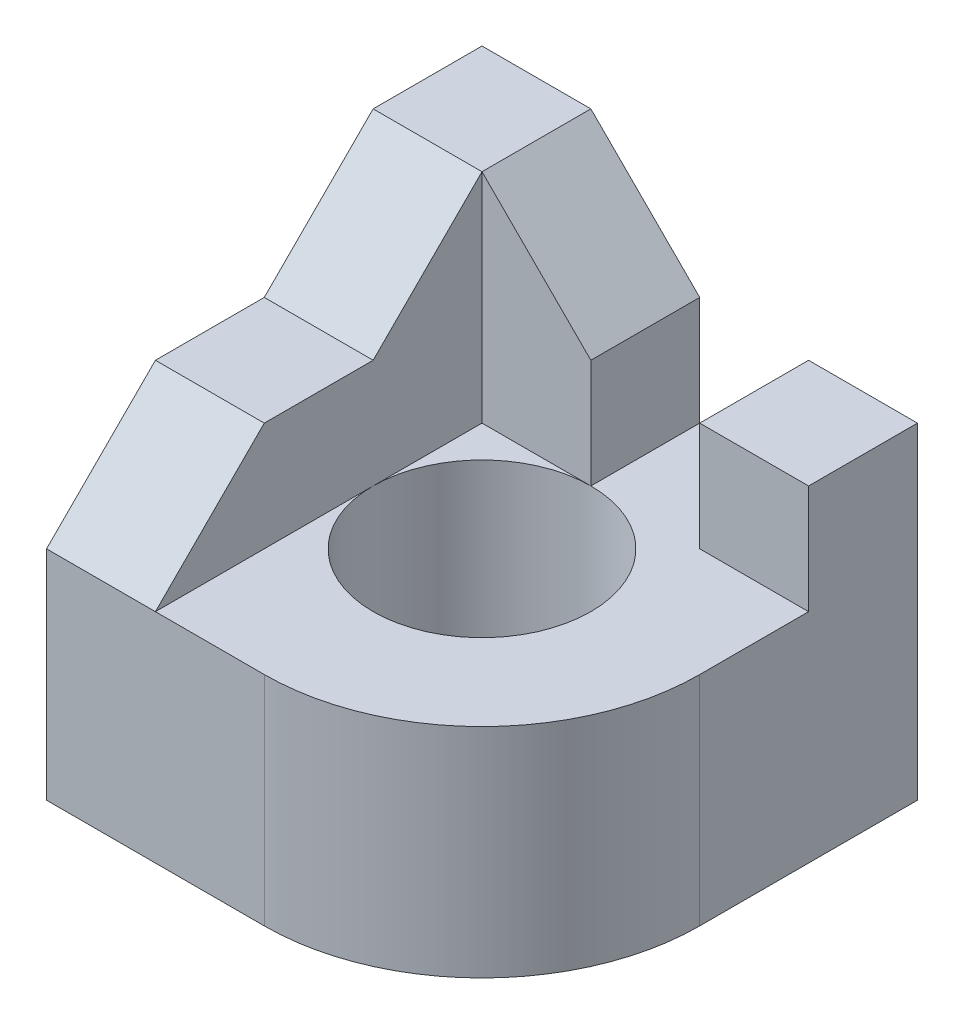
ISO-10303-21;
HEADER;
FILE_DESCRIPTION(('STEP AP214'),'2;1');
FILE_NAME('part.step','',(''),(''),'','','');
FILE_SCHEMA(('AUTOMOTIVE_DESIGN { 1 0 10303 214 1 1 1 1 }'));
ENDSEC;
DATA;
#1=APPLICATION_CONTEXT('core data for automotive mechanical design processes');
#2=APPLICATION_PROTOCOL_DEFINITION('international standard','automotive_design',2000,#1);
#3=PRODUCT_CONTEXT('',#1,'mechanical');
#4=PRODUCT('Part','Part','',(#3));
#5=PRODUCT_RELATED_PRODUCT_CATEGORY('part','',(#4));
#6=PRODUCT_DEFINITION_FORMATION('','',#4);
#7=PRODUCT_DEFINITION_CONTEXT('part definition',#1,'design');
#8=PRODUCT_DEFINITION('design','',#6,#7);
#9=PRODUCT_DEFINITION_SHAPE('','',#8);
#10=(LENGTH_UNIT() NAMED_UNIT(*) SI_UNIT(.MILLI.,.METRE.));
#11=(NAMED_UNIT(*) PLANE_ANGLE_UNIT() SI_UNIT($,.RADIAN.));
#12=(NAMED_UNIT(*) SI_UNIT($,.STERADIAN.) SOLID_ANGLE_UNIT());
#13=UNCERTAINTY_MEASURE_WITH_UNIT(LENGTH_MEASURE(1.E-05),#10,'distance_accuracy_value','');
#14=(GEOMETRIC_REPRESENTATION_CONTEXT(3) GLOBAL_UNCERTAINTY_ASSIGNED_CONTEXT((#13)) GLOBAL_UNIT_ASSIGNED_CONTEXT((#10,
#11,#12)) REPRESENTATION_CONTEXT('',''));
#15=CARTESIAN_POINT('',(0.,0.,0.));
#16=DIRECTION('',(0.,0.,1.));
#17=DIRECTION('',(1.,0.,0.));
#18=AXIS2_PLACEMENT_3D('',#15,#16,#17);
#19=CARTESIAN_POINT('',(0.,2.,0.));
#20=DIRECTION('',(0.,-1.,0.));
#21=DIRECTION('',(0.,0.,-1.));
#22=AXIS2_PLACEMENT_3D('',#19,#20,#21);
#23=CYLINDRICAL_SURFACE('',#22,1.);
#24=CARTESIAN_POINT('',(0.,0.,0.));
#25=DIRECTION('',(0.,1.,0.));
#26=DIRECTION('',(0.,0.,1.));
#27=AXIS2_PLACEMENT_3D('',#24,#25,#26);
#28=CIRCLE('',#27,1.);
#29=CARTESIAN_POINT('',(0.,0.,1.));
#30=VERTEX_POINT('',#29);
#31=EDGE_CURVE('E280',#30,#30,#28,.T.);
#32=ORIENTED_EDGE('',*,*,#31,.F.);
#33=EDGE_LOOP('',(#32));
#34=FACE_BOUND('',#33,.T.);
#35=CARTESIAN_POINT('',(0.,2.,0.));
#36=DIRECTION('',(0.,1.,0.));
#37=DIRECTION('',(0.,0.,1.));
#38=AXIS2_PLACEMENT_3D('',#35,#36,#37);
#39=CIRCLE('',#38,1.);
#40=CARTESIAN_POINT('',(-1.,2.,0.));
#41=VERTEX_POINT('',#40);
#42=CARTESIAN_POINT('',(0.,2.,-0.999999999999996));
#43=VERTEX_POINT('',#42);
#44=EDGE_CURVE('E225',#41,#43,#39,.T.);
#45=ORIENTED_EDGE('',*,*,#44,.T.);
#46=CARTESIAN_POINT('',(0.,2.,0.));
#47=DIRECTION('',(0.,1.,0.));
#48=DIRECTION('',(0.,0.,1.));
#49=AXIS2_PLACEMENT_3D('',#46,#47,#48);
#50=CIRCLE('',#49,1.);
#51=EDGE_CURVE('E281',#43,#41,#50,.T.);
#52=ORIENTED_EDGE('',*,*,#51,.T.);
#53=EDGE_LOOP('',(#45,#52));
#54=FACE_BOUND('',#53,.T.);
#55=ADVANCED_FACE('F71',(#34,#54),#23,.F.);
#56=CARTESIAN_POINT('',(0.,2.,0.));
#57=DIRECTION('',(0.,1.,0.));
#58=DIRECTION('',(0.,0.,1.));
#59=AXIS2_PLACEMENT_3D('',#56,#57,#58);
#60=PLANE('',#59);
#61=ORIENTED_EDGE('',*,*,#51,.F.);
#62=DIRECTION('',(1.,0.,0.));
#63=VECTOR('',#62,1.);
#64=CARTESIAN_POINT('',(0.,2.,-0.999999999999996));
#65=LINE('',#64,#63);
#66=CARTESIAN_POINT('',(-1.,2.,-0.999999999999996));
#67=VERTEX_POINT('',#66);
#68=EDGE_CURVE('E284',#67,#43,#65,.T.);
#69=ORIENTED_EDGE('',*,*,#68,.F.);
#70=DIRECTION('',(0.,0.,1.));
#71=VECTOR('',#70,1.);
#72=CARTESIAN_POINT('',(-1.,2.,0.));
#73=LINE('',#72,#71);
#74=EDGE_CURVE('E287',#67,#41,#73,.T.);
#75=ORIENTED_EDGE('',*,*,#74,.T.);
#76=EDGE_LOOP('',(#61,#69,#75));
#77=FACE_BOUND('',#76,.T.);
#78=ADVANCED_FACE('F357',(#77),#60,.T.);
#79=CARTESIAN_POINT('',(0.,0.,0.));
#80=DIRECTION('',(0.,1.,0.));
#81=DIRECTION('',(0.,0.,1.));
#82=AXIS2_PLACEMENT_3D('',#79,#80,#81);
#83=PLANE('',#82);
#84=DIRECTION('',(-1.,0.,0.));
#85=VECTOR('',#84,1.);
#86=CARTESIAN_POINT('',(0.,0.,-2.));
#87=LINE('',#86,#85);
#88=CARTESIAN_POINT('',(2.,0.,-2.));
#89=VERTEX_POINT('',#88);
#90=CARTESIAN_POINT('',(-2.,0.,-2.));
#91=VERTEX_POINT('',#90);
#92=EDGE_CURVE('E262',#89,#91,#87,.T.);
#93=ORIENTED_EDGE('',*,*,#92,.F.);
#94=DIRECTION('',(0.,0.,1.));
#95=VECTOR('',#94,1.);
#96=CARTESIAN_POINT('',(2.,0.,0.));
#97=LINE('',#96,#95);
#98=CARTESIAN_POINT('',(2.,0.,0.));
#99=VERTEX_POINT('',#98);
#100=EDGE_CURVE('E229',#89,#99,#97,.T.);
#101=ORIENTED_EDGE('',*,*,#100,.T.);
#102=CARTESIAN_POINT('',(0.,0.,0.));
#103=DIRECTION('',(0.,1.,0.));
#104=DIRECTION('',(0.,0.,1.));
#105=AXIS2_PLACEMENT_3D('',#102,#103,#104);
#106=CIRCLE('',#105,2.);
#107=CARTESIAN_POINT('',(0.,0.,2.));
#108=VERTEX_POINT('',#107);
#109=EDGE_CURVE('E254',#99,#108,#106,.F.);
#110=ORIENTED_EDGE('',*,*,#109,.T.);
#111=DIRECTION('',(-1.,0.,0.));
#112=VECTOR('',#111,1.);
#113=CARTESIAN_POINT('',(0.,0.,2.));
#114=LINE('',#113,#112);
#115=CARTESIAN_POINT('',(-2.,0.,2.));
#116=VERTEX_POINT('',#115);
#117=EDGE_CURVE('E224',#108,#116,#114,.T.);
#118=ORIENTED_EDGE('',*,*,#117,.T.);
#119=DIRECTION('',(0.,0.,1.));
#120=VECTOR('',#119,1.);
#121=CARTESIAN_POINT('',(-2.,0.,0.));
#122=LINE('',#121,#120);
#123=EDGE_CURVE('E266',#91,#116,#122,.T.);
#124=ORIENTED_EDGE('',*,*,#123,.F.);
#125=EDGE_LOOP('',(#93,#101,#110,#118,#124));
#126=FACE_BOUND('',#125,.T.);
#127=ORIENTED_EDGE('',*,*,#31,.T.);
#128=EDGE_LOOP('',(#127));
#129=FACE_BOUND('',#128,.T.);
#130=ADVANCED_FACE('F318',(#126,#129),#83,.F.);
#131=CARTESIAN_POINT('',(0.,4.,-0.999999999999996));
#132=DIRECTION('',(0.,0.,-1.));
#133=DIRECTION('',(-1.,0.,0.));
#134=AXIS2_PLACEMENT_3D('',#131,#132,#133);
#135=PLANE('',#134);
#136=DIRECTION('',(0.,-1.,0.));
#137=VECTOR('',#136,1.);
#138=CARTESIAN_POINT('',(0.,4.,-0.999999999999996));
#139=LINE('',#138,#137);
#140=CARTESIAN_POINT('',(0.,3.,-0.999999999999996));
#141=VERTEX_POINT('',#140);
#142=EDGE_CURVE('E278',#141,#43,#139,.T.);
#143=ORIENTED_EDGE('',*,*,#142,.F.);
#144=DIRECTION('',(-0.707106781186546,0.707106781186549,0.));
#145=VECTOR('',#144,1.);
#146=CARTESIAN_POINT('',(-1.,4.,-0.999999999999996));
#147=LINE('',#146,#145);
#148=CARTESIAN_POINT('',(-1.,4.,-0.999999999999996));
#149=VERTEX_POINT('',#148);
#150=EDGE_CURVE('E302',#141,#149,#147,.T.);
#151=ORIENTED_EDGE('',*,*,#150,.T.);
#152=DIRECTION('',(0.,-1.,0.));
#153=VECTOR('',#152,1.);
#154=CARTESIAN_POINT('',(-1.,4.,-0.999999999999996));
#155=LINE('',#154,#153);
#156=EDGE_CURVE('E184',#149,#67,#155,.T.);
#157=ORIENTED_EDGE('',*,*,#156,.T.);
#158=ORIENTED_EDGE('',*,*,#68,.T.);
#159=EDGE_LOOP('',(#143,#151,#157,#158));
#160=FACE_BOUND('',#159,.T.);
#161=ADVANCED_FACE('F358',(#160),#135,.F.);
#162=CARTESIAN_POINT('',(0.,4.,0.));
#163=DIRECTION('',(-1.,0.,0.));
#164=DIRECTION('',(0.,0.,1.));
#165=AXIS2_PLACEMENT_3D('',#162,#163,#164);
#166=PLANE('',#165);
#167=DIRECTION('',(0.,-1.,0.));
#168=VECTOR('',#167,1.);
#169=CARTESIAN_POINT('',(0.,4.,-2.));
#170=LINE('',#169,#168);
#171=CARTESIAN_POINT('',(0.,3.,-2.));
#172=VERTEX_POINT('',#171);
#173=CARTESIAN_POINT('',(0.,2.,-2.));
#174=VERTEX_POINT('',#173);
#175=EDGE_CURVE('E276',#172,#174,#170,.T.);
#176=ORIENTED_EDGE('',*,*,#175,.F.);
#177=DIRECTION('',(0.,0.,1.));
#178=VECTOR('',#177,1.);
#179=CARTESIAN_POINT('',(0.,3.,-0.999999999999996));
#180=LINE('',#179,#178);
#181=EDGE_CURVE('E300',#172,#141,#180,.T.);
#182=ORIENTED_EDGE('',*,*,#181,.T.);
#183=ORIENTED_EDGE('',*,*,#142,.T.);
#184=DIRECTION('',(0.,0.,-1.));
#185=VECTOR('',#184,1.);
#186=CARTESIAN_POINT('',(0.,2.,0.));
#187=LINE('',#186,#185);
#188=EDGE_CURVE('E248',#43,#174,#187,.T.);
#189=ORIENTED_EDGE('',*,*,#188,.T.);
#190=EDGE_LOOP('',(#176,#182,#183,#189));
#191=FACE_BOUND('',#190,.T.);
#192=ADVANCED_FACE('F350',(#191),#166,.F.);
#193=CARTESIAN_POINT('',(0.,4.,-2.));
#194=DIRECTION('',(0.,0.,1.));
#195=DIRECTION('',(1.,0.,0.));
#196=AXIS2_PLACEMENT_3D('',#193,#194,#195);
#197=PLANE('',#196);
#198=DIRECTION('',(-1.,0.,0.));
#199=VECTOR('',#198,1.);
#200=CARTESIAN_POINT('',(0.,4.,-2.));
#201=LINE('',#200,#199);
#202=CARTESIAN_POINT('',(-1.,4.,-2.));
#203=VERTEX_POINT('',#202);
#204=CARTESIAN_POINT('',(-2.,4.,-2.));
#205=VERTEX_POINT('',#204);
#206=EDGE_CURVE('E263',#203,#205,#201,.T.);
#207=ORIENTED_EDGE('',*,*,#206,.F.);
#208=DIRECTION('',(0.707106781186546,-0.707106781186549,0.));
#209=VECTOR('',#208,1.);
#210=CARTESIAN_POINT('',(-1.,4.,-2.));
#211=LINE('',#210,#209);
#212=EDGE_CURVE('E298',#203,#172,#211,.T.);
#213=ORIENTED_EDGE('',*,*,#212,.T.);
#214=ORIENTED_EDGE('',*,*,#175,.T.);
#215=DIRECTION('',(-1.,0.,0.));
#216=VECTOR('',#215,1.);
#217=CARTESIAN_POINT('',(0.,2.,-2.));
#218=LINE('',#217,#216);
#219=CARTESIAN_POINT('',(0.999999999999999,2.,-2.));
#220=VERTEX_POINT('',#219);
#221=EDGE_CURVE('E245',#220,#174,#218,.T.);
#222=ORIENTED_EDGE('',*,*,#221,.F.);
#223=DIRECTION('',(0.,-1.,0.));
#224=VECTOR('',#223,1.);
#225=CARTESIAN_POINT('',(0.999999999999999,3.,-2.));
#226=LINE('',#225,#224);
#227=CARTESIAN_POINT('',(0.999999999999999,3.,-2.));
#228=VERTEX_POINT('',#227);
#229=EDGE_CURVE('E213',#228,#220,#226,.T.);
#230=ORIENTED_EDGE('',*,*,#229,.F.);
#231=DIRECTION('',(-1.,0.,0.));
#232=VECTOR('',#231,1.);
#233=CARTESIAN_POINT('',(0.,3.,-2.));
#234=LINE('',#233,#232);
#235=CARTESIAN_POINT('',(2.,3.,-2.));
#236=VERTEX_POINT('',#235);
#237=EDGE_CURVE('E211',#236,#228,#234,.T.);
#238=ORIENTED_EDGE('',*,*,#237,.F.);
#239=DIRECTION('',(0.,-1.,0.));
#240=VECTOR('',#239,1.);
#241=CARTESIAN_POINT('',(2.,3.,-2.));
#242=LINE('',#241,#240);
#243=EDGE_CURVE('E215',#236,#89,#242,.T.);
#244=ORIENTED_EDGE('',*,*,#243,.T.);
#245=ORIENTED_EDGE('',*,*,#92,.T.);
#246=DIRECTION('',(0.,-1.,0.));
#247=VECTOR('',#246,1.);
#248=CARTESIAN_POINT('',(-2.,4.,-2.));
#249=LINE('',#248,#247);
#250=EDGE_CURVE('E273',#205,#91,#249,.T.);
#251=ORIENTED_EDGE('',*,*,#250,.F.);
#252=EDGE_LOOP('',(#207,#213,#214,#222,#230,#238,#244,#245,#251));
#253=FACE_BOUND('',#252,.T.);
#254=ADVANCED_FACE('F345',(#253),#197,.F.);
#255=CARTESIAN_POINT('',(-2.,4.,0.));
#256=DIRECTION('',(1.,0.,0.));
#257=DIRECTION('',(0.,0.,-1.));
#258=AXIS2_PLACEMENT_3D('',#255,#256,#257);
#259=PLANE('',#258);
#260=DIRECTION('',(0.,0.,1.));
#261=VECTOR('',#260,1.);
#262=CARTESIAN_POINT('',(-2.,3.,0.));
#263=LINE('',#262,#261);
#264=CARTESIAN_POINT('',(-2.,3.,0.));
#265=VERTEX_POINT('',#264);
#266=CARTESIAN_POINT('',(-2.,3.,0.999999999999999));
#267=VERTEX_POINT('',#266);
#268=EDGE_CURVE('E197',#265,#267,#263,.T.);
#269=ORIENTED_EDGE('',*,*,#268,.F.);
#270=DIRECTION('',(0.,-0.707106781186546,0.707106781186549));
#271=VECTOR('',#270,1.);
#272=CARTESIAN_POINT('',(-2.,3.,0.));
#273=LINE('',#272,#271);
#274=CARTESIAN_POINT('',(-2.,4.,-0.999999999999999));
#275=VERTEX_POINT('',#274);
#276=EDGE_CURVE('E196',#265,#275,#273,.F.);
#277=ORIENTED_EDGE('',*,*,#276,.T.);
#278=DIRECTION('',(0.,0.,1.));
#279=VECTOR('',#278,1.);
#280=CARTESIAN_POINT('',(-2.,4.,0.));
#281=LINE('',#280,#279);
#282=EDGE_CURVE('E265',#205,#275,#281,.T.);
#283=ORIENTED_EDGE('',*,*,#282,.F.);
#284=ORIENTED_EDGE('',*,*,#250,.T.);
#285=ORIENTED_EDGE('',*,*,#123,.T.);
#286=DIRECTION('',(0.,-1.,0.));
#287=VECTOR('',#286,1.);
#288=CARTESIAN_POINT('',(-2.,3.,2.));
#289=LINE('',#288,#287);
#290=CARTESIAN_POINT('',(-2.,2.,2.));
#291=VERTEX_POINT('',#290);
#292=EDGE_CURVE('E199',#291,#116,#289,.T.);
#293=ORIENTED_EDGE('',*,*,#292,.F.);
#294=DIRECTION('',(0.,-0.707106781186547,0.707106781186548));
#295=VECTOR('',#294,1.);
#296=CARTESIAN_POINT('',(-2.,2.,2.));
#297=LINE('',#296,#295);
#298=EDGE_CURVE('E92',#291,#267,#297,.F.);
#299=ORIENTED_EDGE('',*,*,#298,.T.);
#300=EDGE_LOOP('',(#269,#277,#283,#284,#285,#293,#299));
#301=FACE_BOUND('',#300,.T.);
#302=ADVANCED_FACE('F313',(#301),#259,.F.);
#303=CARTESIAN_POINT('',(-1.,4.,0.));
#304=DIRECTION('',(1.,0.,0.));
#305=DIRECTION('',(0.,0.,-1.));
#306=AXIS2_PLACEMENT_3D('',#303,#304,#305);
#307=PLANE('',#306);
#308=ORIENTED_EDGE('',*,*,#156,.F.);
#309=DIRECTION('',(0.,0.707106781186546,-0.707106781186549));
#310=VECTOR('',#309,1.);
#311=CARTESIAN_POINT('',(-1.,3.5,-0.499999999999997));
#312=LINE('',#311,#310);
#313=CARTESIAN_POINT('',(-1.,3.,0.));
#314=VERTEX_POINT('',#313);
#315=EDGE_CURVE('E178',#149,#314,#312,.F.);
#316=ORIENTED_EDGE('',*,*,#315,.T.);
#317=DIRECTION('',(0.,0.,1.));
#318=VECTOR('',#317,1.);
#319=CARTESIAN_POINT('',(-1.,3.,0.));
#320=LINE('',#319,#318);
#321=CARTESIAN_POINT('',(-1.,3.,0.999999999999998));
#322=VERTEX_POINT('',#321);
#323=EDGE_CURVE('E180',#314,#322,#320,.T.);
#324=ORIENTED_EDGE('',*,*,#323,.T.);
#325=DIRECTION('',(0.,0.707106781186547,-0.707106781186548));
#326=VECTOR('',#325,1.);
#327=CARTESIAN_POINT('',(-1.,4.,0.));
#328=LINE('',#327,#326);
#329=CARTESIAN_POINT('',(-1.,2.,2.));
#330=VERTEX_POINT('',#329);
#331=EDGE_CURVE('E189',#322,#330,#328,.F.);
#332=ORIENTED_EDGE('',*,*,#331,.T.);
#333=DIRECTION('',(0.,0.,1.));
#334=VECTOR('',#333,1.);
#335=CARTESIAN_POINT('',(-1.,2.,0.));
#336=LINE('',#335,#334);
#337=EDGE_CURVE('E228',#41,#330,#336,.T.);
#338=ORIENTED_EDGE('',*,*,#337,.F.);
#339=ORIENTED_EDGE('',*,*,#74,.F.);
#340=EDGE_LOOP('',(#308,#316,#324,#332,#338,#339));
#341=FACE_BOUND('',#340,.T.);
#342=ADVANCED_FACE('F179',(#341),#307,.T.);
#343=CARTESIAN_POINT('',(0.,4.,0.));
#344=DIRECTION('',(0.,1.,0.));
#345=DIRECTION('',(0.,0.,1.));
#346=AXIS2_PLACEMENT_3D('',#343,#344,#345);
#347=PLANE('',#346);
#348=DIRECTION('',(1.,0.,0.));
#349=VECTOR('',#348,1.);
#350=CARTESIAN_POINT('',(0.,4.,-0.999999999999999));
#351=LINE('',#350,#349);
#352=EDGE_CURVE('E290',#275,#149,#351,.T.);
#353=ORIENTED_EDGE('',*,*,#352,.T.);
#354=DIRECTION('',(0.,0.,-1.));
#355=VECTOR('',#354,1.);
#356=CARTESIAN_POINT('',(-1.,4.,-2.));
#357=LINE('',#356,#355);
#358=EDGE_CURVE('E295',#149,#203,#357,.T.);
#359=ORIENTED_EDGE('',*,*,#358,.T.);
#360=ORIENTED_EDGE('',*,*,#206,.T.);
#361=ORIENTED_EDGE('',*,*,#282,.T.);
#362=EDGE_LOOP('',(#353,#359,#360,#361));
#363=FACE_BOUND('',#362,.T.);
#364=ADVANCED_FACE('F361',(#363),#347,.T.);
#365=CARTESIAN_POINT('',(0.,2.,2.));
#366=DIRECTION('',(0.,0.,1.));
#367=DIRECTION('',(1.,0.,0.));
#368=AXIS2_PLACEMENT_3D('',#365,#366,#367);
#369=PLANE('',#368);
#370=DIRECTION('',(-1.,0.,0.));
#371=VECTOR('',#370,1.);
#372=CARTESIAN_POINT('',(0.,2.,2.));
#373=LINE('',#372,#371);
#374=CARTESIAN_POINT('',(0.,2.,2.));
#375=VERTEX_POINT('',#374);
#376=EDGE_CURVE('E232',#375,#330,#373,.T.);
#377=ORIENTED_EDGE('',*,*,#376,.T.);
#378=DIRECTION('',(-1.,0.,0.));
#379=VECTOR('',#378,1.);
#380=CARTESIAN_POINT('',(0.,2.,2.));
#381=LINE('',#380,#379);
#382=EDGE_CURVE('E79',#330,#291,#381,.T.);
#383=ORIENTED_EDGE('',*,*,#382,.T.);
#384=ORIENTED_EDGE('',*,*,#292,.T.);
#385=ORIENTED_EDGE('',*,*,#117,.F.);
#386=DIRECTION('',(0.,-1.,0.));
#387=VECTOR('',#386,1.);
#388=CARTESIAN_POINT('',(0.,2.,2.));
#389=LINE('',#388,#387);
#390=EDGE_CURVE('E260',#375,#108,#389,.T.);
#391=ORIENTED_EDGE('',*,*,#390,.F.);
#392=EDGE_LOOP('',(#377,#383,#384,#385,#391));
#393=FACE_BOUND('',#392,.T.);
#394=ADVANCED_FACE('F309',(#393),#369,.T.);
#395=CARTESIAN_POINT('',(0.,2.,0.));
#396=DIRECTION('',(0.,-1.,0.));
#397=DIRECTION('',(0.,0.,-1.));
#398=AXIS2_PLACEMENT_3D('',#395,#396,#397);
#399=CYLINDRICAL_SURFACE('',#398,2.);
#400=ORIENTED_EDGE('',*,*,#109,.F.);
#401=DIRECTION('',(0.,-1.,0.));
#402=VECTOR('',#401,1.);
#403=CARTESIAN_POINT('',(2.,2.,0.));
#404=LINE('',#403,#402);
#405=CARTESIAN_POINT('',(2.,2.,0.));
#406=VERTEX_POINT('',#405);
#407=EDGE_CURVE('E251',#406,#99,#404,.T.);
#408=ORIENTED_EDGE('',*,*,#407,.F.);
#409=CARTESIAN_POINT('',(0.,2.,0.));
#410=DIRECTION('',(0.,1.,0.));
#411=DIRECTION('',(0.,0.,1.));
#412=AXIS2_PLACEMENT_3D('',#409,#410,#411);
#413=CIRCLE('',#412,2.);
#414=EDGE_CURVE('E235',#406,#375,#413,.F.);
#415=ORIENTED_EDGE('',*,*,#414,.T.);
#416=ORIENTED_EDGE('',*,*,#390,.T.);
#417=EDGE_LOOP('',(#400,#408,#415,#416));
#418=FACE_BOUND('',#417,.T.);
#419=ADVANCED_FACE('F327',(#418),#399,.T.);
#420=CARTESIAN_POINT('',(2.,2.,0.));
#421=DIRECTION('',(1.,0.,0.));
#422=DIRECTION('',(0.,0.,-1.));
#423=AXIS2_PLACEMENT_3D('',#420,#421,#422);
#424=PLANE('',#423);
#425=ORIENTED_EDGE('',*,*,#100,.F.);
#426=ORIENTED_EDGE('',*,*,#243,.F.);
#427=DIRECTION('',(0.,0.,1.));
#428=VECTOR('',#427,1.);
#429=CARTESIAN_POINT('',(2.,3.,0.));
#430=LINE('',#429,#428);
#431=CARTESIAN_POINT('',(2.,3.,-0.999999999999986));
#432=VERTEX_POINT('',#431);
#433=EDGE_CURVE('E208',#236,#432,#430,.T.);
#434=ORIENTED_EDGE('',*,*,#433,.T.);
#435=DIRECTION('',(0.,-1.,0.));
#436=VECTOR('',#435,1.);
#437=CARTESIAN_POINT('',(2.,3.,-0.999999999999986));
#438=LINE('',#437,#436);
#439=CARTESIAN_POINT('',(2.,2.,-0.999999999999986));
#440=VERTEX_POINT('',#439);
#441=EDGE_CURVE('E218',#432,#440,#438,.T.);
#442=ORIENTED_EDGE('',*,*,#441,.T.);
#443=DIRECTION('',(0.,0.,1.));
#444=VECTOR('',#443,1.);
#445=CARTESIAN_POINT('',(2.,2.,0.));
#446=LINE('',#445,#444);
#447=EDGE_CURVE('E238',#440,#406,#446,.T.);
#448=ORIENTED_EDGE('',*,*,#447,.T.);
#449=ORIENTED_EDGE('',*,*,#407,.T.);
#450=EDGE_LOOP('',(#425,#426,#434,#442,#448,#449));
#451=FACE_BOUND('',#450,.T.);
#452=ADVANCED_FACE('F330',(#451),#424,.T.);
#453=CARTESIAN_POINT('',(0.,2.,0.));
#454=DIRECTION('',(0.,1.,0.));
#455=DIRECTION('',(0.,0.,1.));
#456=AXIS2_PLACEMENT_3D('',#453,#454,#455);
#457=PLANE('',#456);
#458=ORIENTED_EDGE('',*,*,#44,.F.);
#459=ORIENTED_EDGE('',*,*,#337,.T.);
#460=ORIENTED_EDGE('',*,*,#376,.F.);
#461=ORIENTED_EDGE('',*,*,#414,.F.);
#462=ORIENTED_EDGE('',*,*,#447,.F.);
#463=DIRECTION('',(1.,0.,0.));
#464=VECTOR('',#463,1.);
#465=CARTESIAN_POINT('',(0.,2.,-0.999999999999986));
#466=LINE('',#465,#464);
#467=CARTESIAN_POINT('',(0.999999999999999,2.,-0.999999999999986));
#468=VERTEX_POINT('',#467);
#469=EDGE_CURVE('E241',#468,#440,#466,.T.);
#470=ORIENTED_EDGE('',*,*,#469,.F.);
#471=DIRECTION('',(0.,0.,1.));
#472=VECTOR('',#471,1.);
#473=CARTESIAN_POINT('',(1.,2.,0.));
#474=LINE('',#473,#472);
#475=EDGE_CURVE('E243',#220,#468,#474,.T.);
#476=ORIENTED_EDGE('',*,*,#475,.F.);
#477=ORIENTED_EDGE('',*,*,#221,.T.);
#478=ORIENTED_EDGE('',*,*,#188,.F.);
#479=EDGE_LOOP('',(#458,#459,#460,#461,#462,#470,#476,#477,#478));
#480=FACE_BOUND('',#479,.T.);
#481=ADVANCED_FACE('F325',(#480),#457,.T.);
#482=CARTESIAN_POINT('',(1.,3.,0.));
#483=DIRECTION('',(1.,0.,0.));
#484=DIRECTION('',(0.,0.,-1.));
#485=AXIS2_PLACEMENT_3D('',#482,#483,#484);
#486=PLANE('',#485);
#487=ORIENTED_EDGE('',*,*,#475,.T.);
#488=DIRECTION('',(0.,-1.,0.));
#489=VECTOR('',#488,1.);
#490=CARTESIAN_POINT('',(0.999999999999999,3.,-0.999999999999986));
#491=LINE('',#490,#489);
#492=CARTESIAN_POINT('',(0.999999999999999,3.,-0.999999999999986));
#493=VERTEX_POINT('',#492);
#494=EDGE_CURVE('E221',#493,#468,#491,.T.);
#495=ORIENTED_EDGE('',*,*,#494,.F.);
#496=DIRECTION('',(0.,0.,1.));
#497=VECTOR('',#496,1.);
#498=CARTESIAN_POINT('',(1.,3.,0.));
#499=LINE('',#498,#497);
#500=EDGE_CURVE('E203',#228,#493,#499,.T.);
#501=ORIENTED_EDGE('',*,*,#500,.F.);
#502=ORIENTED_EDGE('',*,*,#229,.T.);
#503=EDGE_LOOP('',(#487,#495,#501,#502));
#504=FACE_BOUND('',#503,.T.);
#505=ADVANCED_FACE('F339',(#504),#486,.F.);
#506=CARTESIAN_POINT('',(0.,3.,-0.999999999999986));
#507=DIRECTION('',(0.,0.,-1.));
#508=DIRECTION('',(-1.,0.,0.));
#509=AXIS2_PLACEMENT_3D('',#506,#507,#508);
#510=PLANE('',#509);
#511=ORIENTED_EDGE('',*,*,#469,.T.);
#512=ORIENTED_EDGE('',*,*,#441,.F.);
#513=DIRECTION('',(1.,0.,0.));
#514=VECTOR('',#513,1.);
#515=CARTESIAN_POINT('',(0.,3.,-0.999999999999986));
#516=LINE('',#515,#514);
#517=EDGE_CURVE('E206',#493,#432,#516,.T.);
#518=ORIENTED_EDGE('',*,*,#517,.F.);
#519=ORIENTED_EDGE('',*,*,#494,.T.);
#520=EDGE_LOOP('',(#511,#512,#518,#519));
#521=FACE_BOUND('',#520,.T.);
#522=ADVANCED_FACE('F335',(#521),#510,.F.);
#523=CARTESIAN_POINT('',(0.,3.,0.));
#524=DIRECTION('',(0.,1.,0.));
#525=DIRECTION('',(0.,0.,1.));
#526=AXIS2_PLACEMENT_3D('',#523,#524,#525);
#527=PLANE('',#526);
#528=ORIENTED_EDGE('',*,*,#500,.T.);
#529=ORIENTED_EDGE('',*,*,#517,.T.);
#530=ORIENTED_EDGE('',*,*,#433,.F.);
#531=ORIENTED_EDGE('',*,*,#237,.T.);
#532=EDGE_LOOP('',(#528,#529,#530,#531));
#533=FACE_BOUND('',#532,.T.);
#534=ADVANCED_FACE('F381',(#533),#527,.T.);
#535=CARTESIAN_POINT('',(0.,3.,0.));
#536=DIRECTION('',(0.,1.,0.));
#537=DIRECTION('',(0.,0.,1.));
#538=AXIS2_PLACEMENT_3D('',#535,#536,#537);
#539=PLANE('',#538);
#540=ORIENTED_EDGE('',*,*,#268,.T.);
#541=DIRECTION('',(1.,0.,0.));
#542=VECTOR('',#541,1.);
#543=CARTESIAN_POINT('',(0.,3.,0.999999999999997));
#544=LINE('',#543,#542);
#545=EDGE_CURVE('E12',#267,#322,#544,.T.);
#546=ORIENTED_EDGE('',*,*,#545,.T.);
#547=ORIENTED_EDGE('',*,*,#323,.F.);
#548=DIRECTION('',(-1.,0.,0.));
#549=VECTOR('',#548,1.);
#550=CARTESIAN_POINT('',(0.,3.,0.));
#551=LINE('',#550,#549);
#552=EDGE_CURVE('E193',#314,#265,#551,.T.);
#553=ORIENTED_EDGE('',*,*,#552,.T.);
#554=EDGE_LOOP('',(#540,#546,#547,#553));
#555=FACE_BOUND('',#554,.T.);
#556=ADVANCED_FACE('F192',(#555),#539,.T.);
#557=CARTESIAN_POINT('',(-1.,4.,0.));
#558=DIRECTION('',(0.707106781186549,0.707106781186546,0.));
#559=DIRECTION('',(0.,0.,1.));
#560=AXIS2_PLACEMENT_3D('',#557,#558,#559);
#561=PLANE('',#560);
#562=ORIENTED_EDGE('',*,*,#150,.F.);
#563=ORIENTED_EDGE('',*,*,#181,.F.);
#564=ORIENTED_EDGE('',*,*,#212,.F.);
#565=ORIENTED_EDGE('',*,*,#358,.F.);
#566=EDGE_LOOP('',(#562,#563,#564,#565));
#567=FACE_BOUND('',#566,.T.);
#568=ADVANCED_FACE('F366',(#567),#561,.T.);
#569=CARTESIAN_POINT('',(0.,3.,0.));
#570=DIRECTION('',(0.,-0.707106781186549,-0.707106781186546));
#571=DIRECTION('',(-1.,0.,0.));
#572=AXIS2_PLACEMENT_3D('',#569,#570,#571);
#573=PLANE('',#572);
#574=ORIENTED_EDGE('',*,*,#315,.F.);
#575=ORIENTED_EDGE('',*,*,#352,.F.);
#576=ORIENTED_EDGE('',*,*,#276,.F.);
#577=ORIENTED_EDGE('',*,*,#552,.F.);
#578=EDGE_LOOP('',(#574,#575,#576,#577));
#579=FACE_BOUND('',#578,.T.);
#580=ADVANCED_FACE('F195',(#579),#573,.F.);
#581=CARTESIAN_POINT('',(0.,2.,2.));
#582=DIRECTION('',(0.,-0.707106781186548,-0.707106781186547));
#583=DIRECTION('',(-1.,0.,0.));
#584=AXIS2_PLACEMENT_3D('',#581,#582,#583);
#585=PLANE('',#584);
#586=ORIENTED_EDGE('',*,*,#331,.F.);
#587=ORIENTED_EDGE('',*,*,#545,.F.);
#588=ORIENTED_EDGE('',*,*,#298,.F.);
#589=ORIENTED_EDGE('',*,*,#382,.F.);
#590=EDGE_LOOP('',(#586,#587,#588,#589));
#591=FACE_BOUND('',#590,.T.);
#592=ADVANCED_FACE('F73',(#591),#585,.F.);
#593=CLOSED_SHELL('',(#55,#78,#130,#161,#192,#254,#302,#342,#364,#394,#419,#452,#481,#505,#522,
#534,#556,#568,#580,#592));
#594=MANIFOLD_SOLID_BREP('B2',#593);
#595=ADVANCED_BREP_SHAPE_REPRESENTATION('',(#18,#594),#14);
#596=SHAPE_DEFINITION_REPRESENTATION(#9,#595);
ENDSEC;
END-ISO-10303-21;
